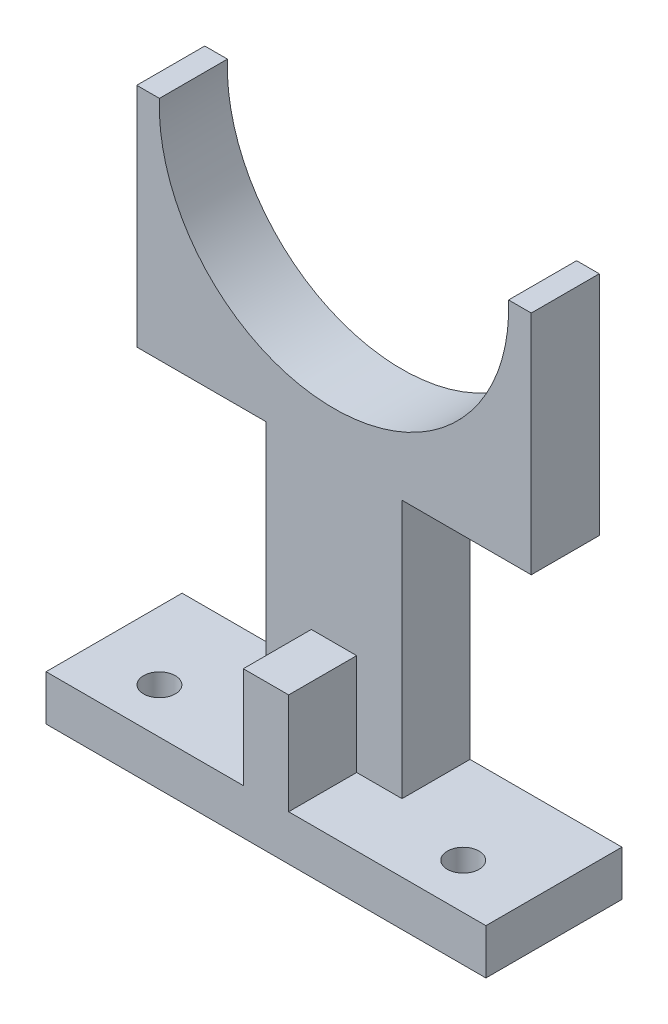
ISO-10303-21;
HEADER;
FILE_DESCRIPTION(('STEP AP214'),'2;1');
FILE_NAME('part.step','',(''),(''),'','','');
FILE_SCHEMA(('AUTOMOTIVE_DESIGN { 1 0 10303 214 1 1 1 1 }'));
ENDSEC;
DATA;
#1=APPLICATION_CONTEXT('core data for automotive mechanical design processes');
#2=APPLICATION_PROTOCOL_DEFINITION('international standard','automotive_design',2000,#1);
#3=PRODUCT_CONTEXT('',#1,'mechanical');
#4=PRODUCT('Part','Part','',(#3));
#5=PRODUCT_RELATED_PRODUCT_CATEGORY('part','',(#4));
#6=PRODUCT_DEFINITION_FORMATION('','',#4);
#7=PRODUCT_DEFINITION_CONTEXT('part definition',#1,'design');
#8=PRODUCT_DEFINITION('design','',#6,#7);
#9=PRODUCT_DEFINITION_SHAPE('','',#8);
#10=(LENGTH_UNIT() NAMED_UNIT(*) SI_UNIT(.MILLI.,.METRE.));
#11=(NAMED_UNIT(*) PLANE_ANGLE_UNIT() SI_UNIT($,.RADIAN.));
#12=(NAMED_UNIT(*) SI_UNIT($,.STERADIAN.) SOLID_ANGLE_UNIT());
#13=UNCERTAINTY_MEASURE_WITH_UNIT(LENGTH_MEASURE(1.E-05),#10,'distance_accuracy_value','');
#14=(GEOMETRIC_REPRESENTATION_CONTEXT(3) GLOBAL_UNCERTAINTY_ASSIGNED_CONTEXT((#13)) GLOBAL_UNIT_ASSIGNED_CONTEXT((#10,
#11,#12)) REPRESENTATION_CONTEXT('',''));
#15=CARTESIAN_POINT('',(0.,0.,0.));
#16=DIRECTION('',(0.,0.,1.));
#17=DIRECTION('',(1.,0.,0.));
#18=AXIS2_PLACEMENT_3D('',#15,#16,#17);
#19=CARTESIAN_POINT('',(0.,95.7704918032787,15.));
#20=DIRECTION('',(0.,-1.,0.));
#21=DIRECTION('',(0.,0.,-1.));
#22=AXIS2_PLACEMENT_3D('',#19,#20,#21);
#23=PLANE('',#22);
#24=DIRECTION('',(-1.,0.,0.));
#25=VECTOR('',#24,1.);
#26=CARTESIAN_POINT('',(0.,95.7704918032787,0.));
#27=LINE('',#26,#25);
#28=CARTESIAN_POINT('',(14.6276835039859,95.7704918032787,0.));
#29=VERTEX_POINT('',#28);
#30=CARTESIAN_POINT('',(9.62768350398589,95.7704918032787,0.));
#31=VERTEX_POINT('',#30);
#32=EDGE_CURVE('E242',#29,#31,#27,.T.);
#33=ORIENTED_EDGE('',*,*,#32,.T.);
#34=DIRECTION('',(0.,0.,-1.));
#35=VECTOR('',#34,1.);
#36=CARTESIAN_POINT('',(9.62768350398589,95.7704918032787,15.));
#37=LINE('',#36,#35);
#38=CARTESIAN_POINT('',(9.62768350398589,95.7704918032787,15.));
#39=VERTEX_POINT('',#38);
#40=EDGE_CURVE('E44',#39,#31,#37,.T.);
#41=ORIENTED_EDGE('',*,*,#40,.F.);
#42=DIRECTION('',(-1.,0.,0.));
#43=VECTOR('',#42,1.);
#44=CARTESIAN_POINT('',(0.,95.7704918032787,15.));
#45=LINE('',#44,#43);
#46=CARTESIAN_POINT('',(14.6276835039859,95.7704918032787,15.));
#47=VERTEX_POINT('',#46);
#48=EDGE_CURVE('E243',#47,#39,#45,.T.);
#49=ORIENTED_EDGE('',*,*,#48,.F.);
#50=DIRECTION('',(0.,0.,-1.));
#51=VECTOR('',#50,1.);
#52=CARTESIAN_POINT('',(14.6276835039859,95.7704918032787,15.));
#53=LINE('',#52,#51);
#54=EDGE_CURVE('E274',#47,#29,#53,.T.);
#55=ORIENTED_EDGE('',*,*,#54,.T.);
#56=EDGE_LOOP('',(#33,#41,#49,#55));
#57=FACE_BOUND('',#56,.T.);
#58=ADVANCED_FACE('F41',(#57),#23,.F.);
#59=CARTESIAN_POINT('',(-28.8723164960141,94.2986168032787,15.));
#60=DIRECTION('',(0.,0.,-1.));
#61=DIRECTION('',(-1.,0.,0.));
#62=AXIS2_PLACEMENT_3D('',#59,#60,#61);
#63=CYLINDRICAL_SURFACE('',#62,38.528125);
#64=CARTESIAN_POINT('',(-28.8723164960141,94.2986168032787,0.));
#65=DIRECTION('',(0.,0.,1.));
#66=DIRECTION('',(1.,0.,0.));
#67=AXIS2_PLACEMENT_3D('',#64,#65,#66);
#68=CIRCLE('',#67,38.528125);
#69=CARTESIAN_POINT('',(-67.3723164960141,95.7704918032787,0.));
#70=VERTEX_POINT('',#69);
#71=EDGE_CURVE('E278',#31,#70,#68,.F.);
#72=ORIENTED_EDGE('',*,*,#71,.T.);
#73=DIRECTION('',(0.,0.,-1.));
#74=VECTOR('',#73,1.);
#75=CARTESIAN_POINT('',(-67.3723164960141,95.7704918032787,15.));
#76=LINE('',#75,#74);
#77=CARTESIAN_POINT('',(-67.3723164960141,95.7704918032787,15.));
#78=VERTEX_POINT('',#77);
#79=EDGE_CURVE('E349',#78,#70,#76,.T.);
#80=ORIENTED_EDGE('',*,*,#79,.F.);
#81=CARTESIAN_POINT('',(-28.8723164960141,94.2986168032787,15.));
#82=DIRECTION('',(0.,0.,1.));
#83=DIRECTION('',(1.,0.,0.));
#84=AXIS2_PLACEMENT_3D('',#81,#82,#83);
#85=CIRCLE('',#84,38.528125);
#86=EDGE_CURVE('E247',#39,#78,#85,.F.);
#87=ORIENTED_EDGE('',*,*,#86,.F.);
#88=ORIENTED_EDGE('',*,*,#40,.T.);
#89=EDGE_LOOP('',(#72,#80,#87,#88));
#90=FACE_BOUND('',#89,.T.);
#91=ADVANCED_FACE('F358',(#90),#63,.F.);
#92=CARTESIAN_POINT('',(0.,95.7704918032787,15.));
#93=DIRECTION('',(0.,1.,0.));
#94=DIRECTION('',(0.,0.,1.));
#95=AXIS2_PLACEMENT_3D('',#92,#93,#94);
#96=PLANE('',#95);
#97=DIRECTION('',(1.,0.,0.));
#98=VECTOR('',#97,1.);
#99=CARTESIAN_POINT('',(0.,95.7704918032787,0.));
#100=LINE('',#99,#98);
#101=CARTESIAN_POINT('',(-72.3723164960141,95.7704918032787,0.));
#102=VERTEX_POINT('',#101);
#103=EDGE_CURVE('E282',#102,#70,#100,.T.);
#104=ORIENTED_EDGE('',*,*,#103,.F.);
#105=DIRECTION('',(0.,0.,-1.));
#106=VECTOR('',#105,1.);
#107=CARTESIAN_POINT('',(-72.3723164960141,95.7704918032787,15.));
#108=LINE('',#107,#106);
#109=CARTESIAN_POINT('',(-72.3723164960141,95.7704918032787,15.));
#110=VERTEX_POINT('',#109);
#111=EDGE_CURVE('E347',#110,#102,#108,.T.);
#112=ORIENTED_EDGE('',*,*,#111,.F.);
#113=DIRECTION('',(1.,0.,0.));
#114=VECTOR('',#113,1.);
#115=CARTESIAN_POINT('',(0.,95.7704918032787,15.));
#116=LINE('',#115,#114);
#117=EDGE_CURVE('E251',#110,#78,#116,.T.);
#118=ORIENTED_EDGE('',*,*,#117,.T.);
#119=ORIENTED_EDGE('',*,*,#79,.T.);
#120=EDGE_LOOP('',(#104,#112,#118,#119));
#121=FACE_BOUND('',#120,.T.);
#122=ADVANCED_FACE('F404',(#121),#96,.T.);
#123=CARTESIAN_POINT('',(-72.3723164960141,0.,15.));
#124=DIRECTION('',(-1.,0.,0.));
#125=DIRECTION('',(0.,0.,1.));
#126=AXIS2_PLACEMENT_3D('',#123,#124,#125);
#127=PLANE('',#126);
#128=DIRECTION('',(0.,1.,0.));
#129=VECTOR('',#128,1.);
#130=CARTESIAN_POINT('',(-72.3723164960141,0.,0.));
#131=LINE('',#130,#129);
#132=CARTESIAN_POINT('',(-72.3723164960141,45.7704918032787,0.));
#133=VERTEX_POINT('',#132);
#134=EDGE_CURVE('E286',#133,#102,#131,.T.);
#135=ORIENTED_EDGE('',*,*,#134,.F.);
#136=DIRECTION('',(0.,0.,-1.));
#137=VECTOR('',#136,1.);
#138=CARTESIAN_POINT('',(-72.3723164960141,45.7704918032787,15.));
#139=LINE('',#138,#137);
#140=CARTESIAN_POINT('',(-72.3723164960141,45.7704918032787,15.));
#141=VERTEX_POINT('',#140);
#142=EDGE_CURVE('E344',#141,#133,#139,.T.);
#143=ORIENTED_EDGE('',*,*,#142,.F.);
#144=DIRECTION('',(0.,1.,0.));
#145=VECTOR('',#144,1.);
#146=CARTESIAN_POINT('',(-72.3723164960141,0.,15.));
#147=LINE('',#146,#145);
#148=EDGE_CURVE('E255',#141,#110,#147,.T.);
#149=ORIENTED_EDGE('',*,*,#148,.T.);
#150=ORIENTED_EDGE('',*,*,#111,.T.);
#151=EDGE_LOOP('',(#135,#143,#149,#150));
#152=FACE_BOUND('',#151,.T.);
#153=ADVANCED_FACE('F400',(#152),#127,.T.);
#154=CARTESIAN_POINT('',(0.,45.7704918032787,15.));
#155=DIRECTION('',(0.,1.,0.));
#156=DIRECTION('',(0.,0.,1.));
#157=AXIS2_PLACEMENT_3D('',#154,#155,#156);
#158=PLANE('',#157);
#159=DIRECTION('',(1.,0.,0.));
#160=VECTOR('',#159,1.);
#161=CARTESIAN_POINT('',(0.,45.7704918032787,0.));
#162=LINE('',#161,#160);
#163=CARTESIAN_POINT('',(-43.8723164960141,45.7704918032787,0.));
#164=VERTEX_POINT('',#163);
#165=EDGE_CURVE('E290',#133,#164,#162,.T.);
#166=ORIENTED_EDGE('',*,*,#165,.T.);
#167=DIRECTION('',(0.,0.,-1.));
#168=VECTOR('',#167,1.);
#169=CARTESIAN_POINT('',(-43.8723164960141,45.7704918032787,15.));
#170=LINE('',#169,#168);
#171=CARTESIAN_POINT('',(-43.8723164960141,45.7704918032787,15.));
#172=VERTEX_POINT('',#171);
#173=EDGE_CURVE('E340',#172,#164,#170,.T.);
#174=ORIENTED_EDGE('',*,*,#173,.F.);
#175=DIRECTION('',(1.,0.,0.));
#176=VECTOR('',#175,1.);
#177=CARTESIAN_POINT('',(0.,45.7704918032787,15.));
#178=LINE('',#177,#176);
#179=EDGE_CURVE('E259',#141,#172,#178,.T.);
#180=ORIENTED_EDGE('',*,*,#179,.F.);
#181=ORIENTED_EDGE('',*,*,#142,.T.);
#182=EDGE_LOOP('',(#166,#174,#180,#181));
#183=FACE_BOUND('',#182,.T.);
#184=ADVANCED_FACE('F411',(#183),#158,.F.);
#185=CARTESIAN_POINT('',(-43.8723164960141,0.,15.));
#186=DIRECTION('',(1.,0.,0.));
#187=DIRECTION('',(0.,1.,0.));
#188=AXIS2_PLACEMENT_3D('',#185,#186,#187);
#189=PLANE('',#188);
#190=DIRECTION('',(0.,-1.,0.));
#191=VECTOR('',#190,1.);
#192=CARTESIAN_POINT('',(-43.8723164960141,0.,0.));
#193=LINE('',#192,#191);
#194=CARTESIAN_POINT('',(-43.8723164960141,-11.2295081967213,0.));
#195=VERTEX_POINT('',#194);
#196=EDGE_CURVE('E293',#164,#195,#193,.T.);
#197=ORIENTED_EDGE('',*,*,#196,.T.);
#198=DIRECTION('',(0.,0.,-1.));
#199=VECTOR('',#198,1.);
#200=CARTESIAN_POINT('',(-43.8723164960141,-11.2295081967213,15.));
#201=LINE('',#200,#199);
#202=CARTESIAN_POINT('',(-43.8723164960141,-11.2295081967213,15.));
#203=VERTEX_POINT('',#202);
#204=EDGE_CURVE('E337',#203,#195,#201,.T.);
#205=ORIENTED_EDGE('',*,*,#204,.F.);
#206=DIRECTION('',(0.,-1.,0.));
#207=VECTOR('',#206,1.);
#208=CARTESIAN_POINT('',(-43.8723164960141,0.,15.));
#209=LINE('',#208,#207);
#210=EDGE_CURVE('E262',#172,#203,#209,.T.);
#211=ORIENTED_EDGE('',*,*,#210,.F.);
#212=ORIENTED_EDGE('',*,*,#173,.T.);
#213=EDGE_LOOP('',(#197,#205,#211,#212));
#214=FACE_BOUND('',#213,.T.);
#215=ADVANCED_FACE('F394',(#214),#189,.F.);
#216=CARTESIAN_POINT('',(0.,-11.2295081967213,15.));
#217=DIRECTION('',(0.,1.,0.));
#218=DIRECTION('',(-1.,0.,0.));
#219=AXIS2_PLACEMENT_3D('',#216,#217,#218);
#220=PLANE('',#219);
#221=CARTESIAN_POINT('',(-62.3723164960141,-11.2295081967213,20.));
#222=DIRECTION('',(0.,1.,0.));
#223=DIRECTION('',(-1.,0.,0.));
#224=AXIS2_PLACEMENT_3D('',#221,#222,#223);
#225=CIRCLE('',#224,3.5);
#226=CARTESIAN_POINT('',(-65.8723164960141,-11.2295081967213,20.));
#227=VERTEX_POINT('',#226);
#228=EDGE_CURVE('E656',#227,#227,#225,.T.);
#229=ORIENTED_EDGE('',*,*,#228,.F.);
#230=EDGE_LOOP('',(#229));
#231=FACE_BOUND('',#230,.T.);
#232=DIRECTION('',(1.,0.,0.));
#233=VECTOR('',#232,1.);
#234=CARTESIAN_POINT('',(0.,-11.2295081967213,0.));
#235=LINE('',#234,#233);
#236=CARTESIAN_POINT('',(-77.3723164960141,-11.2295081967213,0.));
#237=VERTEX_POINT('',#236);
#238=EDGE_CURVE('E298',#237,#195,#235,.T.);
#239=ORIENTED_EDGE('',*,*,#238,.F.);
#240=DIRECTION('',(0.,0.,-1.));
#241=VECTOR('',#240,1.);
#242=CARTESIAN_POINT('',(-77.3723164960141,-11.2295081967213,15.));
#243=LINE('',#242,#241);
#244=CARTESIAN_POINT('',(-77.3723164960141,-11.2295081967213,30.));
#245=VERTEX_POINT('',#244);
#246=EDGE_CURVE('E176',#245,#237,#243,.T.);
#247=ORIENTED_EDGE('',*,*,#246,.F.);
#248=DIRECTION('',(-1.,0.,0.));
#249=VECTOR('',#248,1.);
#250=CARTESIAN_POINT('',(-33.8723164960141,-11.2295081967213,30.));
#251=LINE('',#250,#249);
#252=CARTESIAN_POINT('',(-33.8723164960141,-11.2295081967213,30.));
#253=VERTEX_POINT('',#252);
#254=EDGE_CURVE('E191',#253,#245,#251,.T.);
#255=ORIENTED_EDGE('',*,*,#254,.F.);
#256=DIRECTION('',(0.,0.,-1.));
#257=VECTOR('',#256,1.);
#258=CARTESIAN_POINT('',(-33.8723164960141,-11.2295081967213,30.));
#259=LINE('',#258,#257);
#260=CARTESIAN_POINT('',(-33.8723164960141,-11.2295081967213,15.));
#261=VERTEX_POINT('',#260);
#262=EDGE_CURVE('E215',#253,#261,#259,.T.);
#263=ORIENTED_EDGE('',*,*,#262,.T.);
#264=DIRECTION('',(-1.,0.,0.));
#265=VECTOR('',#264,1.);
#266=CARTESIAN_POINT('',(-33.8723164960141,-11.2295081967213,15.));
#267=LINE('',#266,#265);
#268=EDGE_CURVE('E57',#261,#203,#267,.T.);
#269=ORIENTED_EDGE('',*,*,#268,.T.);
#270=ORIENTED_EDGE('',*,*,#204,.T.);
#271=EDGE_LOOP('',(#239,#247,#255,#263,#269,#270));
#272=FACE_BOUND('',#271,.T.);
#273=ADVANCED_FACE('F390',(#231,#272),#220,.T.);
#274=CARTESIAN_POINT('',(-77.3723164960141,0.,15.));
#275=DIRECTION('',(1.,0.,0.));
#276=DIRECTION('',(0.,0.,-1.));
#277=AXIS2_PLACEMENT_3D('',#274,#275,#276);
#278=PLANE('',#277);
#279=DIRECTION('',(0.,-1.,0.));
#280=VECTOR('',#279,1.);
#281=CARTESIAN_POINT('',(-77.3723164960141,0.,0.));
#282=LINE('',#281,#280);
#283=CARTESIAN_POINT('',(-77.3723164960141,-21.2295081967213,0.));
#284=VERTEX_POINT('',#283);
#285=EDGE_CURVE('E171',#237,#284,#282,.T.);
#286=ORIENTED_EDGE('',*,*,#285,.T.);
#287=DIRECTION('',(0.,0.,-1.));
#288=VECTOR('',#287,1.);
#289=CARTESIAN_POINT('',(-77.3723164960141,-21.2295081967213,15.));
#290=LINE('',#289,#288);
#291=CARTESIAN_POINT('',(-77.3723164960141,-21.2295081967213,30.));
#292=VERTEX_POINT('',#291);
#293=EDGE_CURVE('E165',#292,#284,#290,.T.);
#294=ORIENTED_EDGE('',*,*,#293,.F.);
#295=DIRECTION('',(0.,-1.,0.));
#296=VECTOR('',#295,1.);
#297=CARTESIAN_POINT('',(-77.3723164960141,-11.2295081967213,30.));
#298=LINE('',#297,#296);
#299=EDGE_CURVE('E169',#245,#292,#298,.T.);
#300=ORIENTED_EDGE('',*,*,#299,.F.);
#301=ORIENTED_EDGE('',*,*,#246,.T.);
#302=EDGE_LOOP('',(#286,#294,#300,#301));
#303=FACE_BOUND('',#302,.T.);
#304=ADVANCED_FACE('F167',(#303),#278,.F.);
#305=CARTESIAN_POINT('',(0.,-21.2295081967213,15.));
#306=DIRECTION('',(0.,1.,0.));
#307=DIRECTION('',(0.,0.,1.));
#308=AXIS2_PLACEMENT_3D('',#305,#306,#307);
#309=PLANE('',#308);
#310=CARTESIAN_POINT('',(-62.3723164960141,-21.2295081967213,20.));
#311=DIRECTION('',(0.,1.,0.));
#312=DIRECTION('',(-1.,0.,0.));
#313=AXIS2_PLACEMENT_3D('',#310,#311,#312);
#314=CIRCLE('',#313,2.);
#315=CARTESIAN_POINT('',(-64.3723164960141,-21.2295081967213,20.));
#316=VERTEX_POINT('',#315);
#317=EDGE_CURVE('E649',#316,#316,#314,.T.);
#318=ORIENTED_EDGE('',*,*,#317,.T.);
#319=EDGE_LOOP('',(#318));
#320=FACE_BOUND('',#319,.T.);
#321=CARTESIAN_POINT('',(4.6276835039859,-21.2295081967213,20.));
#322=DIRECTION('',(0.,1.,0.));
#323=DIRECTION('',(-1.,0.,0.));
#324=AXIS2_PLACEMENT_3D('',#321,#322,#323);
#325=CIRCLE('',#324,2.);
#326=CARTESIAN_POINT('',(2.6276835039859,-21.2295081967213,20.));
#327=VERTEX_POINT('',#326);
#328=EDGE_CURVE('E667',#327,#327,#325,.T.);
#329=ORIENTED_EDGE('',*,*,#328,.T.);
#330=EDGE_LOOP('',(#329));
#331=FACE_BOUND('',#330,.T.);
#332=DIRECTION('',(1.,0.,0.));
#333=VECTOR('',#332,1.);
#334=CARTESIAN_POINT('',(0.,-21.2295081967213,0.));
#335=LINE('',#334,#333);
#336=CARTESIAN_POINT('',(19.6276835039859,-21.2295081967213,0.));
#337=VERTEX_POINT('',#336);
#338=EDGE_CURVE('E305',#284,#337,#335,.T.);
#339=ORIENTED_EDGE('',*,*,#338,.T.);
#340=DIRECTION('',(0.,0.,-1.));
#341=VECTOR('',#340,1.);
#342=CARTESIAN_POINT('',(19.6276835039859,-21.2295081967213,15.));
#343=LINE('',#342,#341);
#344=CARTESIAN_POINT('',(19.6276835039859,-21.2295081967213,30.));
#345=VERTEX_POINT('',#344);
#346=EDGE_CURVE('E177',#345,#337,#343,.T.);
#347=ORIENTED_EDGE('',*,*,#346,.F.);
#348=DIRECTION('',(1.,0.,0.));
#349=VECTOR('',#348,1.);
#350=CARTESIAN_POINT('',(-77.3723164960141,-21.2295081967213,30.));
#351=LINE('',#350,#349);
#352=EDGE_CURVE('E180',#292,#345,#351,.T.);
#353=ORIENTED_EDGE('',*,*,#352,.F.);
#354=ORIENTED_EDGE('',*,*,#293,.T.);
#355=EDGE_LOOP('',(#339,#347,#353,#354));
#356=FACE_BOUND('',#355,.T.);
#357=ADVANCED_FACE('F181',(#320,#331,#356),#309,.F.);
#358=CARTESIAN_POINT('',(19.6276835039859,0.,15.));
#359=DIRECTION('',(1.,0.,0.));
#360=DIRECTION('',(0.,0.,-1.));
#361=AXIS2_PLACEMENT_3D('',#358,#359,#360);
#362=PLANE('',#361);
#363=DIRECTION('',(0.,-1.,0.));
#364=VECTOR('',#363,1.);
#365=CARTESIAN_POINT('',(19.6276835039859,0.,0.));
#366=LINE('',#365,#364);
#367=CARTESIAN_POINT('',(19.6276835039859,-11.2295081967213,0.));
#368=VERTEX_POINT('',#367);
#369=EDGE_CURVE('E308',#368,#337,#366,.T.);
#370=ORIENTED_EDGE('',*,*,#369,.F.);
#371=DIRECTION('',(0.,0.,-1.));
#372=VECTOR('',#371,1.);
#373=CARTESIAN_POINT('',(19.6276835039859,-11.2295081967213,15.));
#374=LINE('',#373,#372);
#375=CARTESIAN_POINT('',(19.6276835039859,-11.2295081967213,30.));
#376=VERTEX_POINT('',#375);
#377=EDGE_CURVE('E330',#376,#368,#374,.T.);
#378=ORIENTED_EDGE('',*,*,#377,.F.);
#379=DIRECTION('',(0.,1.,0.));
#380=VECTOR('',#379,1.);
#381=CARTESIAN_POINT('',(19.6276835039859,-21.2295081967213,30.));
#382=LINE('',#381,#380);
#383=EDGE_CURVE('E186',#345,#376,#382,.T.);
#384=ORIENTED_EDGE('',*,*,#383,.F.);
#385=ORIENTED_EDGE('',*,*,#346,.T.);
#386=EDGE_LOOP('',(#370,#378,#384,#385));
#387=FACE_BOUND('',#386,.T.);
#388=ADVANCED_FACE('F386',(#387),#362,.T.);
#389=CARTESIAN_POINT('',(4.6276835039859,-11.2295081967213,20.));
#390=DIRECTION('',(0.,1.,0.));
#391=DIRECTION('',(-1.,0.,0.));
#392=AXIS2_PLACEMENT_3D('',#389,#390,#391);
#393=CIRCLE('',#392,3.5);
#394=CARTESIAN_POINT('',(1.1276835039859,-11.2295081967213,20.));
#395=VERTEX_POINT('',#394);
#396=EDGE_CURVE('E197',#395,#395,#393,.T.);
#397=ORIENTED_EDGE('',*,*,#396,.F.);
#398=EDGE_LOOP('',(#397));
#399=FACE_BOUND('',#398,.T.);
#400=CARTESIAN_POINT('',(-13.8723164960141,-11.2295081967213,0.));
#401=VERTEX_POINT('',#400);
#402=EDGE_CURVE('E302',#401,#368,#235,.T.);
#403=ORIENTED_EDGE('',*,*,#402,.F.);
#404=DIRECTION('',(0.,0.,-1.));
#405=VECTOR('',#404,1.);
#406=CARTESIAN_POINT('',(-13.8723164960141,-11.2295081967213,15.));
#407=LINE('',#406,#405);
#408=CARTESIAN_POINT('',(-13.8723164960141,-11.2295081967213,15.));
#409=VERTEX_POINT('',#408);
#410=EDGE_CURVE('E327',#409,#401,#407,.T.);
#411=ORIENTED_EDGE('',*,*,#410,.F.);
#412=DIRECTION('',(-1.,0.,0.));
#413=VECTOR('',#412,1.);
#414=CARTESIAN_POINT('',(19.6276835039859,-11.2295081967213,15.));
#415=LINE('',#414,#413);
#416=CARTESIAN_POINT('',(-23.8723164960141,-11.2295081967213,15.));
#417=VERTEX_POINT('',#416);
#418=EDGE_CURVE('E11',#409,#417,#415,.T.);
#419=ORIENTED_EDGE('',*,*,#418,.T.);
#420=DIRECTION('',(0.,0.,-1.));
#421=VECTOR('',#420,1.);
#422=CARTESIAN_POINT('',(-23.8723164960141,-11.2295081967213,30.));
#423=LINE('',#422,#421);
#424=CARTESIAN_POINT('',(-23.8723164960141,-11.2295081967213,30.));
#425=VERTEX_POINT('',#424);
#426=EDGE_CURVE('E238',#425,#417,#423,.T.);
#427=ORIENTED_EDGE('',*,*,#426,.F.);
#428=DIRECTION('',(-1.,0.,0.));
#429=VECTOR('',#428,1.);
#430=CARTESIAN_POINT('',(19.6276835039859,-11.2295081967213,30.));
#431=LINE('',#430,#429);
#432=EDGE_CURVE('E202',#376,#425,#431,.T.);
#433=ORIENTED_EDGE('',*,*,#432,.F.);
#434=ORIENTED_EDGE('',*,*,#377,.T.);
#435=EDGE_LOOP('',(#403,#411,#419,#427,#433,#434));
#436=FACE_BOUND('',#435,.T.);
#437=ADVANCED_FACE('F382',(#399,#436),#220,.T.);
#438=CARTESIAN_POINT('',(-13.8723164960141,0.,15.));
#439=DIRECTION('',(1.,0.,0.));
#440=DIRECTION('',(0.,1.,0.));
#441=AXIS2_PLACEMENT_3D('',#438,#439,#440);
#442=PLANE('',#441);
#443=DIRECTION('',(0.,-1.,0.));
#444=VECTOR('',#443,1.);
#445=CARTESIAN_POINT('',(-13.8723164960141,0.,0.));
#446=LINE('',#445,#444);
#447=CARTESIAN_POINT('',(-13.8723164960141,45.7704918032787,0.));
#448=VERTEX_POINT('',#447);
#449=EDGE_CURVE('E312',#448,#401,#446,.T.);
#450=ORIENTED_EDGE('',*,*,#449,.F.);
#451=DIRECTION('',(0.,0.,-1.));
#452=VECTOR('',#451,1.);
#453=CARTESIAN_POINT('',(-13.8723164960141,45.7704918032787,15.));
#454=LINE('',#453,#452);
#455=CARTESIAN_POINT('',(-13.8723164960141,45.7704918032787,15.));
#456=VERTEX_POINT('',#455);
#457=EDGE_CURVE('E324',#456,#448,#454,.T.);
#458=ORIENTED_EDGE('',*,*,#457,.F.);
#459=DIRECTION('',(0.,-1.,0.));
#460=VECTOR('',#459,1.);
#461=CARTESIAN_POINT('',(-13.8723164960141,0.,15.));
#462=LINE('',#461,#460);
#463=EDGE_CURVE('E266',#456,#409,#462,.T.);
#464=ORIENTED_EDGE('',*,*,#463,.T.);
#465=ORIENTED_EDGE('',*,*,#410,.T.);
#466=EDGE_LOOP('',(#450,#458,#464,#465));
#467=FACE_BOUND('',#466,.T.);
#468=ADVANCED_FACE('F451',(#467),#442,.T.);
#469=CARTESIAN_POINT('',(14.6276835039859,45.7704918032787,0.));
#470=VERTEX_POINT('',#469);
#471=EDGE_CURVE('E294',#448,#470,#162,.T.);
#472=ORIENTED_EDGE('',*,*,#471,.T.);
#473=DIRECTION('',(0.,0.,-1.));
#474=VECTOR('',#473,1.);
#475=CARTESIAN_POINT('',(14.6276835039859,45.7704918032787,15.));
#476=LINE('',#475,#474);
#477=CARTESIAN_POINT('',(14.6276835039859,45.7704918032787,15.));
#478=VERTEX_POINT('',#477);
#479=EDGE_CURVE('E321',#478,#470,#476,.T.);
#480=ORIENTED_EDGE('',*,*,#479,.F.);
#481=EDGE_CURVE('E263',#456,#478,#178,.T.);
#482=ORIENTED_EDGE('',*,*,#481,.F.);
#483=ORIENTED_EDGE('',*,*,#457,.T.);
#484=EDGE_LOOP('',(#472,#480,#482,#483));
#485=FACE_BOUND('',#484,.T.);
#486=ADVANCED_FACE('F373',(#485),#158,.F.);
#487=CARTESIAN_POINT('',(14.6276835039859,0.,15.));
#488=DIRECTION('',(1.,0.,0.));
#489=DIRECTION('',(0.,1.,0.));
#490=AXIS2_PLACEMENT_3D('',#487,#488,#489);
#491=PLANE('',#490);
#492=DIRECTION('',(0.,-1.,0.));
#493=VECTOR('',#492,1.);
#494=CARTESIAN_POINT('',(14.6276835039859,0.,0.));
#495=LINE('',#494,#493);
#496=EDGE_CURVE('E248',#29,#470,#495,.T.);
#497=ORIENTED_EDGE('',*,*,#496,.F.);
#498=ORIENTED_EDGE('',*,*,#54,.F.);
#499=DIRECTION('',(0.,-1.,0.));
#500=VECTOR('',#499,1.);
#501=CARTESIAN_POINT('',(14.6276835039859,0.,15.));
#502=LINE('',#501,#500);
#503=EDGE_CURVE('E270',#47,#478,#502,.T.);
#504=ORIENTED_EDGE('',*,*,#503,.T.);
#505=ORIENTED_EDGE('',*,*,#479,.T.);
#506=EDGE_LOOP('',(#497,#498,#504,#505));
#507=FACE_BOUND('',#506,.T.);
#508=ADVANCED_FACE('F367',(#507),#491,.T.);
#509=CARTESIAN_POINT('',(0.,0.,15.));
#510=DIRECTION('',(0.,0.,1.));
#511=DIRECTION('',(1.,0.,0.));
#512=AXIS2_PLACEMENT_3D('',#509,#510,#511);
#513=PLANE('',#512);
#514=ORIENTED_EDGE('',*,*,#268,.F.);
#515=DIRECTION('',(0.,-1.,0.));
#516=VECTOR('',#515,1.);
#517=CARTESIAN_POINT('',(-33.8723164960141,11.0910294047244,15.));
#518=LINE('',#517,#516);
#519=CARTESIAN_POINT('',(-33.8723164960141,11.0910294047244,15.));
#520=VERTEX_POINT('',#519);
#521=EDGE_CURVE('E61',#520,#261,#518,.T.);
#522=ORIENTED_EDGE('',*,*,#521,.F.);
#523=DIRECTION('',(-1.,0.,0.));
#524=VECTOR('',#523,1.);
#525=CARTESIAN_POINT('',(-23.8723164960141,11.0910294047244,15.));
#526=LINE('',#525,#524);
#527=CARTESIAN_POINT('',(-23.8723164960141,11.0910294047244,15.));
#528=VERTEX_POINT('',#527);
#529=EDGE_CURVE('E221',#528,#520,#526,.T.);
#530=ORIENTED_EDGE('',*,*,#529,.F.);
#531=DIRECTION('',(0.,1.,0.));
#532=VECTOR('',#531,1.);
#533=CARTESIAN_POINT('',(-23.8723164960141,-11.2295081967213,15.));
#534=LINE('',#533,#532);
#535=EDGE_CURVE('E217',#417,#528,#534,.T.);
#536=ORIENTED_EDGE('',*,*,#535,.F.);
#537=ORIENTED_EDGE('',*,*,#418,.F.);
#538=ORIENTED_EDGE('',*,*,#463,.F.);
#539=ORIENTED_EDGE('',*,*,#481,.T.);
#540=ORIENTED_EDGE('',*,*,#503,.F.);
#541=ORIENTED_EDGE('',*,*,#48,.T.);
#542=ORIENTED_EDGE('',*,*,#86,.T.);
#543=ORIENTED_EDGE('',*,*,#117,.F.);
#544=ORIENTED_EDGE('',*,*,#148,.F.);
#545=ORIENTED_EDGE('',*,*,#179,.T.);
#546=ORIENTED_EDGE('',*,*,#210,.T.);
#547=EDGE_LOOP('',(#514,#522,#530,#536,#537,#538,#539,#540,#541,#542,#543,#544,#545,#546));
#548=FACE_BOUND('',#547,.T.);
#549=ADVANCED_FACE('F462',(#548),#513,.T.);
#550=CARTESIAN_POINT('',(0.,0.,0.));
#551=DIRECTION('',(0.,0.,1.));
#552=DIRECTION('',(1.,0.,0.));
#553=AXIS2_PLACEMENT_3D('',#550,#551,#552);
#554=PLANE('',#553);
#555=ORIENTED_EDGE('',*,*,#32,.F.);
#556=ORIENTED_EDGE('',*,*,#496,.T.);
#557=ORIENTED_EDGE('',*,*,#471,.F.);
#558=ORIENTED_EDGE('',*,*,#449,.T.);
#559=ORIENTED_EDGE('',*,*,#402,.T.);
#560=ORIENTED_EDGE('',*,*,#369,.T.);
#561=ORIENTED_EDGE('',*,*,#338,.F.);
#562=ORIENTED_EDGE('',*,*,#285,.F.);
#563=ORIENTED_EDGE('',*,*,#238,.T.);
#564=ORIENTED_EDGE('',*,*,#196,.F.);
#565=ORIENTED_EDGE('',*,*,#165,.F.);
#566=ORIENTED_EDGE('',*,*,#134,.T.);
#567=ORIENTED_EDGE('',*,*,#103,.T.);
#568=ORIENTED_EDGE('',*,*,#71,.F.);
#569=EDGE_LOOP('',(#555,#556,#557,#558,#559,#560,#561,#562,#563,#564,#565,#566,#567,#568));
#570=FACE_BOUND('',#569,.T.);
#571=ADVANCED_FACE('F364',(#570),#554,.F.);
#572=CARTESIAN_POINT('',(-23.8723164960141,-11.2295081967213,30.));
#573=DIRECTION('',(-1.,0.,0.));
#574=DIRECTION('',(0.,-1.,0.));
#575=AXIS2_PLACEMENT_3D('',#572,#573,#574);
#576=PLANE('',#575);
#577=ORIENTED_EDGE('',*,*,#535,.T.);
#578=DIRECTION('',(0.,0.,-1.));
#579=VECTOR('',#578,1.);
#580=CARTESIAN_POINT('',(-23.8723164960141,11.0910294047244,30.));
#581=LINE('',#580,#579);
#582=CARTESIAN_POINT('',(-23.8723164960141,11.0910294047244,30.));
#583=VERTEX_POINT('',#582);
#584=EDGE_CURVE('E234',#583,#528,#581,.T.);
#585=ORIENTED_EDGE('',*,*,#584,.F.);
#586=DIRECTION('',(0.,1.,0.));
#587=VECTOR('',#586,1.);
#588=CARTESIAN_POINT('',(-23.8723164960141,-11.2295081967213,30.));
#589=LINE('',#588,#587);
#590=EDGE_CURVE('E205',#425,#583,#589,.T.);
#591=ORIENTED_EDGE('',*,*,#590,.F.);
#592=ORIENTED_EDGE('',*,*,#426,.T.);
#593=EDGE_LOOP('',(#577,#585,#591,#592));
#594=FACE_BOUND('',#593,.T.);
#595=ADVANCED_FACE('F473',(#594),#576,.F.);
#596=CARTESIAN_POINT('',(-23.8723164960141,11.0910294047244,30.));
#597=DIRECTION('',(0.,-1.,0.));
#598=DIRECTION('',(1.,0.,0.));
#599=AXIS2_PLACEMENT_3D('',#596,#597,#598);
#600=PLANE('',#599);
#601=ORIENTED_EDGE('',*,*,#529,.T.);
#602=DIRECTION('',(0.,0.,-1.));
#603=VECTOR('',#602,1.);
#604=CARTESIAN_POINT('',(-33.8723164960141,11.0910294047244,30.));
#605=LINE('',#604,#603);
#606=CARTESIAN_POINT('',(-33.8723164960141,11.0910294047244,30.));
#607=VERTEX_POINT('',#606);
#608=EDGE_CURVE('E230',#607,#520,#605,.T.);
#609=ORIENTED_EDGE('',*,*,#608,.F.);
#610=DIRECTION('',(-1.,0.,0.));
#611=VECTOR('',#610,1.);
#612=CARTESIAN_POINT('',(-23.8723164960141,11.0910294047244,30.));
#613=LINE('',#612,#611);
#614=EDGE_CURVE('E208',#583,#607,#613,.T.);
#615=ORIENTED_EDGE('',*,*,#614,.F.);
#616=ORIENTED_EDGE('',*,*,#584,.T.);
#617=EDGE_LOOP('',(#601,#609,#615,#616));
#618=FACE_BOUND('',#617,.T.);
#619=ADVANCED_FACE('F532',(#618),#600,.F.);
#620=CARTESIAN_POINT('',(-33.8723164960141,11.0910294047244,30.));
#621=DIRECTION('',(1.,0.,0.));
#622=DIRECTION('',(0.,0.,-1.));
#623=AXIS2_PLACEMENT_3D('',#620,#621,#622);
#624=PLANE('',#623);
#625=ORIENTED_EDGE('',*,*,#521,.T.);
#626=ORIENTED_EDGE('',*,*,#262,.F.);
#627=DIRECTION('',(0.,-1.,0.));
#628=VECTOR('',#627,1.);
#629=CARTESIAN_POINT('',(-33.8723164960141,11.0910294047244,30.));
#630=LINE('',#629,#628);
#631=EDGE_CURVE('E211',#607,#253,#630,.T.);
#632=ORIENTED_EDGE('',*,*,#631,.F.);
#633=ORIENTED_EDGE('',*,*,#608,.T.);
#634=EDGE_LOOP('',(#625,#626,#632,#633));
#635=FACE_BOUND('',#634,.T.);
#636=ADVANCED_FACE('F542',(#635),#624,.F.);
#637=CARTESIAN_POINT('',(0.,0.,30.));
#638=DIRECTION('',(0.,0.,1.));
#639=DIRECTION('',(1.,0.,0.));
#640=AXIS2_PLACEMENT_3D('',#637,#638,#639);
#641=PLANE('',#640);
#642=ORIENTED_EDGE('',*,*,#299,.T.);
#643=ORIENTED_EDGE('',*,*,#352,.T.);
#644=ORIENTED_EDGE('',*,*,#383,.T.);
#645=ORIENTED_EDGE('',*,*,#432,.T.);
#646=ORIENTED_EDGE('',*,*,#590,.T.);
#647=ORIENTED_EDGE('',*,*,#614,.T.);
#648=ORIENTED_EDGE('',*,*,#631,.T.);
#649=ORIENTED_EDGE('',*,*,#254,.T.);
#650=EDGE_LOOP('',(#642,#643,#644,#645,#646,#647,#648,#649));
#651=FACE_BOUND('',#650,.T.);
#652=ADVANCED_FACE('F189',(#651),#641,.T.);
#653=CARTESIAN_POINT('',(4.6276835039859,-16.2295081967213,20.));
#654=DIRECTION('',(0.,1.,0.));
#655=DIRECTION('',(-1.,0.,0.));
#656=AXIS2_PLACEMENT_3D('',#653,#654,#655);
#657=CYLINDRICAL_SURFACE('',#656,3.5);
#658=CARTESIAN_POINT('',(4.6276835039859,-16.2295081967213,20.));
#659=DIRECTION('',(0.,1.,0.));
#660=DIRECTION('',(-1.,0.,0.));
#661=AXIS2_PLACEMENT_3D('',#658,#659,#660);
#662=CIRCLE('',#661,3.5);
#663=CARTESIAN_POINT('',(1.1276835039859,-16.2295081967213,20.));
#664=VERTEX_POINT('',#663);
#665=EDGE_CURVE('E222',#664,#664,#662,.T.);
#666=ORIENTED_EDGE('',*,*,#665,.F.);
#667=EDGE_LOOP('',(#666));
#668=FACE_BOUND('',#667,.T.);
#669=ORIENTED_EDGE('',*,*,#396,.T.);
#670=EDGE_LOOP('',(#669));
#671=FACE_BOUND('',#670,.T.);
#672=ADVANCED_FACE('F561',(#668,#671),#657,.F.);
#673=CARTESIAN_POINT('',(4.6276835039859,-16.2295081967213,20.));
#674=DIRECTION('',(0.,1.,0.));
#675=DIRECTION('',(-1.,0.,0.));
#676=AXIS2_PLACEMENT_3D('',#673,#674,#675);
#677=PLANE('',#676);
#678=CARTESIAN_POINT('',(4.6276835039859,-16.2295081967213,20.));
#679=DIRECTION('',(0.,1.,0.));
#680=DIRECTION('',(-1.,0.,0.));
#681=AXIS2_PLACEMENT_3D('',#678,#679,#680);
#682=CIRCLE('',#681,2.);
#683=CARTESIAN_POINT('',(2.6276835039859,-16.2295081967213,20.));
#684=VERTEX_POINT('',#683);
#685=EDGE_CURVE('E663',#684,#684,#682,.T.);
#686=ORIENTED_EDGE('',*,*,#685,.F.);
#687=EDGE_LOOP('',(#686));
#688=FACE_BOUND('',#687,.T.);
#689=ORIENTED_EDGE('',*,*,#665,.T.);
#690=EDGE_LOOP('',(#689));
#691=FACE_BOUND('',#690,.T.);
#692=ADVANCED_FACE('F577',(#688,#691),#677,.T.);
#693=CARTESIAN_POINT('',(4.6276835039859,-21.2295081967213,20.));
#694=DIRECTION('',(0.,1.,0.));
#695=DIRECTION('',(-1.,0.,0.));
#696=AXIS2_PLACEMENT_3D('',#693,#694,#695);
#697=CYLINDRICAL_SURFACE('',#696,2.);
#698=ORIENTED_EDGE('',*,*,#328,.F.);
#699=EDGE_LOOP('',(#698));
#700=FACE_BOUND('',#699,.T.);
#701=ORIENTED_EDGE('',*,*,#685,.T.);
#702=EDGE_LOOP('',(#701));
#703=FACE_BOUND('',#702,.T.);
#704=ADVANCED_FACE('F587',(#700,#703),#697,.F.);
#705=CARTESIAN_POINT('',(-62.3723164960141,-16.2295081967213,20.));
#706=DIRECTION('',(0.,1.,0.));
#707=DIRECTION('',(-1.,0.,0.));
#708=AXIS2_PLACEMENT_3D('',#705,#706,#707);
#709=CYLINDRICAL_SURFACE('',#708,3.5);
#710=CARTESIAN_POINT('',(-62.3723164960141,-16.2295081967213,20.));
#711=DIRECTION('',(0.,1.,0.));
#712=DIRECTION('',(-1.,0.,0.));
#713=AXIS2_PLACEMENT_3D('',#710,#711,#712);
#714=CIRCLE('',#713,3.5);
#715=CARTESIAN_POINT('',(-65.8723164960141,-16.2295081967213,20.));
#716=VERTEX_POINT('',#715);
#717=EDGE_CURVE('E659',#716,#716,#714,.T.);
#718=ORIENTED_EDGE('',*,*,#717,.F.);
#719=EDGE_LOOP('',(#718));
#720=FACE_BOUND('',#719,.T.);
#721=ORIENTED_EDGE('',*,*,#228,.T.);
#722=EDGE_LOOP('',(#721));
#723=FACE_BOUND('',#722,.T.);
#724=ADVANCED_FACE('F597',(#720,#723),#709,.F.);
#725=CARTESIAN_POINT('',(-62.3723164960141,-16.2295081967213,20.));
#726=DIRECTION('',(0.,1.,0.));
#727=DIRECTION('',(-1.,0.,0.));
#728=AXIS2_PLACEMENT_3D('',#725,#726,#727);
#729=PLANE('',#728);
#730=CARTESIAN_POINT('',(-62.3723164960141,-16.2295081967213,20.));
#731=DIRECTION('',(0.,1.,0.));
#732=DIRECTION('',(-1.,0.,0.));
#733=AXIS2_PLACEMENT_3D('',#730,#731,#732);
#734=CIRCLE('',#733,2.);
#735=CARTESIAN_POINT('',(-64.3723164960141,-16.2295081967213,20.));
#736=VERTEX_POINT('',#735);
#737=EDGE_CURVE('E652',#736,#736,#734,.T.);
#738=ORIENTED_EDGE('',*,*,#737,.F.);
#739=EDGE_LOOP('',(#738));
#740=FACE_BOUND('',#739,.T.);
#741=ORIENTED_EDGE('',*,*,#717,.T.);
#742=EDGE_LOOP('',(#741));
#743=FACE_BOUND('',#742,.T.);
#744=ADVANCED_FACE('F614',(#740,#743),#729,.T.);
#745=CARTESIAN_POINT('',(-62.3723164960141,-21.2295081967213,20.));
#746=DIRECTION('',(0.,1.,0.));
#747=DIRECTION('',(-1.,0.,0.));
#748=AXIS2_PLACEMENT_3D('',#745,#746,#747);
#749=CYLINDRICAL_SURFACE('',#748,2.);
#750=ORIENTED_EDGE('',*,*,#317,.F.);
#751=EDGE_LOOP('',(#750));
#752=FACE_BOUND('',#751,.T.);
#753=ORIENTED_EDGE('',*,*,#737,.T.);
#754=EDGE_LOOP('',(#753));
#755=FACE_BOUND('',#754,.T.);
#756=ADVANCED_FACE('F632',(#752,#755),#749,.F.);
#757=CLOSED_SHELL('',(#58,#91,#122,#153,#184,#215,#273,#304,#357,#388,#437,#468,#486,#508,#549,
#571,#595,#619,#636,#652,#672,#692,#704,#724,#744,#756));
#758=MANIFOLD_SOLID_BREP('B2',#757);
#759=ADVANCED_BREP_SHAPE_REPRESENTATION('',(#18,#758),#14);
#760=SHAPE_DEFINITION_REPRESENTATION(#9,#759);
ENDSEC;
END-ISO-10303-21;
